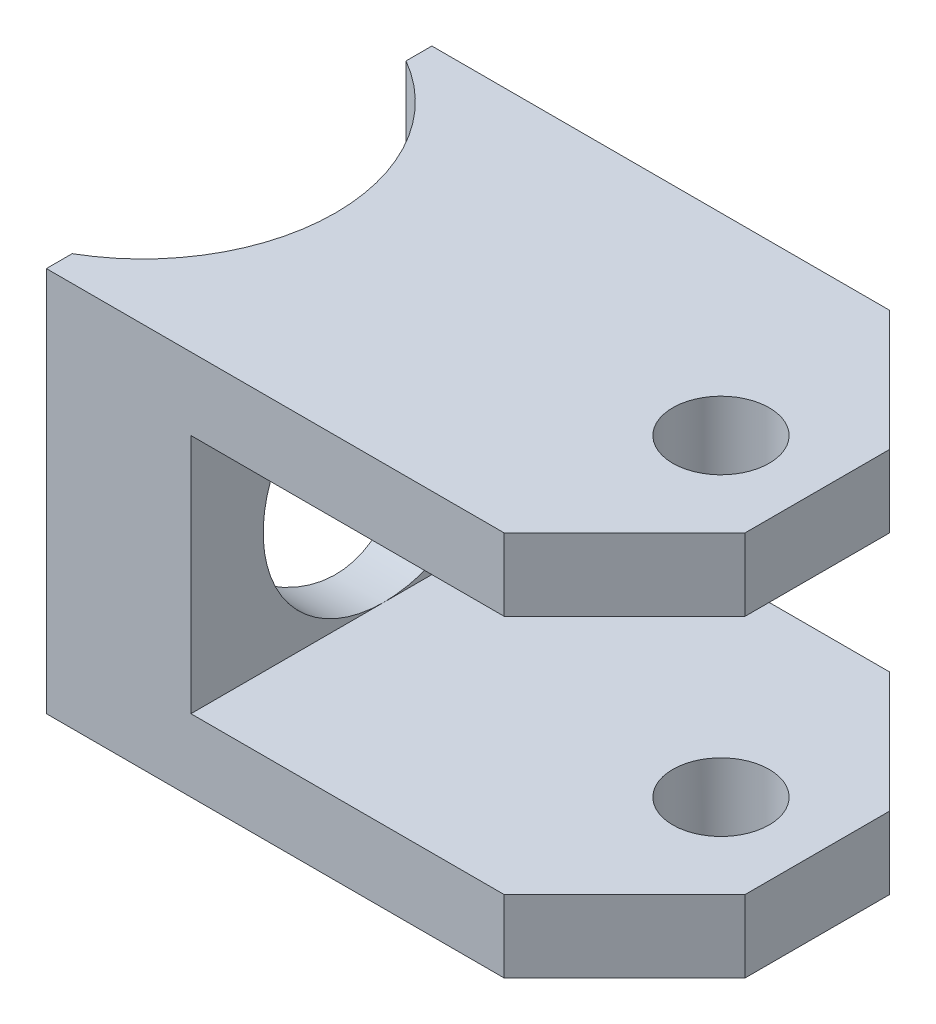
ISO-10303-21;
HEADER;
FILE_DESCRIPTION(('STEP AP214'),'2;1');
FILE_NAME('part.step','',(''),(''),'','','');
FILE_SCHEMA(('AUTOMOTIVE_DESIGN { 1 0 10303 214 1 1 1 1 }'));
ENDSEC;
DATA;
#1=APPLICATION_CONTEXT('core data for automotive mechanical design processes');
#2=APPLICATION_PROTOCOL_DEFINITION('international standard','automotive_design',2000,#1);
#3=PRODUCT_CONTEXT('',#1,'mechanical');
#4=PRODUCT('Part','Part','',(#3));
#5=PRODUCT_RELATED_PRODUCT_CATEGORY('part','',(#4));
#6=PRODUCT_DEFINITION_FORMATION('','',#4);
#7=PRODUCT_DEFINITION_CONTEXT('part definition',#1,'design');
#8=PRODUCT_DEFINITION('design','',#6,#7);
#9=PRODUCT_DEFINITION_SHAPE('','',#8);
#10=(LENGTH_UNIT() NAMED_UNIT(*) SI_UNIT(.MILLI.,.METRE.));
#11=(NAMED_UNIT(*) PLANE_ANGLE_UNIT() SI_UNIT($,.RADIAN.));
#12=(NAMED_UNIT(*) SI_UNIT($,.STERADIAN.) SOLID_ANGLE_UNIT());
#13=UNCERTAINTY_MEASURE_WITH_UNIT(LENGTH_MEASURE(1.E-05),#10,'distance_accuracy_value','');
#14=(GEOMETRIC_REPRESENTATION_CONTEXT(3) GLOBAL_UNCERTAINTY_ASSIGNED_CONTEXT((#13)) GLOBAL_UNIT_ASSIGNED_CONTEXT((#10,
#11,#12)) REPRESENTATION_CONTEXT('',''));
#15=CARTESIAN_POINT('',(0.,0.,0.));
#16=DIRECTION('',(0.,0.,1.));
#17=DIRECTION('',(1.,0.,0.));
#18=AXIS2_PLACEMENT_3D('',#15,#16,#17);
#19=CARTESIAN_POINT('',(6.35,12.7,12.7));
#20=DIRECTION('',(1.,0.,0.));
#21=DIRECTION('',(0.,0.,-1.));
#22=AXIS2_PLACEMENT_3D('',#19,#20,#21);
#23=PLANE('',#22);
#24=DIRECTION('',(0.,0.,-1.));
#25=VECTOR('',#24,1.);
#26=CARTESIAN_POINT('',(6.35,-12.7,12.7));
#27=LINE('',#26,#25);
#28=CARTESIAN_POINT('',(6.35,-12.7,-10.9985226280624));
#29=VERTEX_POINT('',#28);
#30=CARTESIAN_POINT('',(6.35,-12.7,-12.7));
#31=VERTEX_POINT('',#30);
#32=EDGE_CURVE('E169',#29,#31,#27,.T.);
#33=ORIENTED_EDGE('',*,*,#32,.F.);
#34=DIRECTION('',(0.,1.,0.));
#35=VECTOR('',#34,1.);
#36=CARTESIAN_POINT('',(6.35,-12.7,-10.9985226280624));
#37=LINE('',#36,#35);
#38=CARTESIAN_POINT('',(6.35,12.7,-10.9985226280624));
#39=VERTEX_POINT('',#38);
#40=EDGE_CURVE('E56',#29,#39,#37,.T.);
#41=ORIENTED_EDGE('',*,*,#40,.T.);
#42=DIRECTION('',(0.,0.,-1.));
#43=VECTOR('',#42,1.);
#44=CARTESIAN_POINT('',(6.35,12.7,12.7));
#45=LINE('',#44,#43);
#46=CARTESIAN_POINT('',(6.35,12.7,-12.7));
#47=VERTEX_POINT('',#46);
#48=EDGE_CURVE('E168',#39,#47,#45,.T.);
#49=ORIENTED_EDGE('',*,*,#48,.T.);
#50=DIRECTION('',(0.,-1.,0.));
#51=VECTOR('',#50,1.);
#52=CARTESIAN_POINT('',(6.35,12.7,-12.7));
#53=LINE('',#52,#51);
#54=EDGE_CURVE('E257',#47,#31,#53,.T.);
#55=ORIENTED_EDGE('',*,*,#54,.T.);
#56=EDGE_LOOP('',(#33,#41,#49,#55));
#57=FACE_BOUND('',#56,.T.);
#58=ADVANCED_FACE('F35',(#57),#23,.F.);
#59=CARTESIAN_POINT('',(15.875,7.9375,12.7));
#60=DIRECTION('',(-1.,0.,0.));
#61=DIRECTION('',(0.,0.,1.));
#62=AXIS2_PLACEMENT_3D('',#59,#60,#61);
#63=PLANE('',#62);
#64=DIRECTION('',(0.,0.,-1.));
#65=VECTOR('',#64,1.);
#66=CARTESIAN_POINT('',(15.875,7.9375,12.7));
#67=LINE('',#66,#65);
#68=CARTESIAN_POINT('',(15.875,7.9375,0.));
#69=VERTEX_POINT('',#68);
#70=CARTESIAN_POINT('',(15.875,7.9375,-12.7));
#71=VERTEX_POINT('',#70);
#72=EDGE_CURVE('E182',#69,#71,#67,.T.);
#73=ORIENTED_EDGE('',*,*,#72,.F.);
#74=CARTESIAN_POINT('',(15.875,0.,0.));
#75=DIRECTION('',(1.,0.,0.));
#76=DIRECTION('',(0.,1.,0.));
#77=AXIS2_PLACEMENT_3D('',#74,#75,#76);
#78=CIRCLE('',#77,7.9375);
#79=CARTESIAN_POINT('',(15.875,-7.9375,0.));
#80=VERTEX_POINT('',#79);
#81=EDGE_CURVE('E63',#80,#69,#78,.T.);
#82=ORIENTED_EDGE('',*,*,#81,.F.);
#83=DIRECTION('',(0.,0.,-1.));
#84=VECTOR('',#83,1.);
#85=CARTESIAN_POINT('',(15.875,-7.9375,12.7));
#86=LINE('',#85,#84);
#87=CARTESIAN_POINT('',(15.875,-7.9375,-12.7));
#88=VERTEX_POINT('',#87);
#89=EDGE_CURVE('E186',#80,#88,#86,.T.);
#90=ORIENTED_EDGE('',*,*,#89,.T.);
#91=DIRECTION('',(0.,1.,0.));
#92=VECTOR('',#91,1.);
#93=CARTESIAN_POINT('',(15.875,7.9375,-12.7));
#94=LINE('',#93,#92);
#95=EDGE_CURVE('E247',#88,#71,#94,.T.);
#96=ORIENTED_EDGE('',*,*,#95,.T.);
#97=EDGE_LOOP('',(#73,#82,#90,#96));
#98=FACE_BOUND('',#97,.T.);
#99=ADVANCED_FACE('F288',(#98),#63,.F.);
#100=CARTESIAN_POINT('',(44.45,-7.9375,12.7));
#101=DIRECTION('',(0.,-1.,0.));
#102=DIRECTION('',(0.,0.,-1.));
#103=AXIS2_PLACEMENT_3D('',#100,#101,#102);
#104=PLANE('',#103);
#105=CARTESIAN_POINT('',(38.1,-7.9375,0.));
#106=DIRECTION('',(0.,-1.,0.));
#107=DIRECTION('',(0.,0.,-1.));
#108=AXIS2_PLACEMENT_3D('',#105,#106,#107);
#109=CIRCLE('',#108,3.175);
#110=CARTESIAN_POINT('',(38.1,-7.9375,-3.175));
#111=VERTEX_POINT('',#110);
#112=EDGE_CURVE('E300',#111,#111,#109,.T.);
#113=ORIENTED_EDGE('',*,*,#112,.T.);
#114=EDGE_LOOP('',(#113));
#115=FACE_BOUND('',#114,.T.);
#116=DIRECTION('',(0.,0.,-1.));
#117=VECTOR('',#116,1.);
#118=CARTESIAN_POINT('',(44.45,-7.9375,12.7));
#119=LINE('',#118,#117);
#120=CARTESIAN_POINT('',(44.45,-7.9375,4.76249999999997));
#121=VERTEX_POINT('',#120);
#122=CARTESIAN_POINT('',(44.45,-7.9375,-4.7625));
#123=VERTEX_POINT('',#122);
#124=EDGE_CURVE('E243',#121,#123,#119,.T.);
#125=ORIENTED_EDGE('',*,*,#124,.T.);
#126=DIRECTION('',(0.707106781186549,0.,0.707106781186546));
#127=VECTOR('',#126,1.);
#128=CARTESIAN_POINT('',(44.45,-7.9375,-4.7625));
#129=LINE('',#128,#127);
#130=CARTESIAN_POINT('',(36.5125,-7.9375,-12.7));
#131=VERTEX_POINT('',#130);
#132=EDGE_CURVE('E214',#123,#131,#129,.F.);
#133=ORIENTED_EDGE('',*,*,#132,.T.);
#134=DIRECTION('',(-1.,0.,0.));
#135=VECTOR('',#134,1.);
#136=CARTESIAN_POINT('',(44.45,-7.9375,-12.7));
#137=LINE('',#136,#135);
#138=EDGE_CURVE('E244',#131,#88,#137,.T.);
#139=ORIENTED_EDGE('',*,*,#138,.T.);
#140=ORIENTED_EDGE('',*,*,#89,.F.);
#141=CARTESIAN_POINT('',(15.875,-7.9375,12.7));
#142=VERTEX_POINT('',#141);
#143=EDGE_CURVE('E187',#142,#80,#86,.T.);
#144=ORIENTED_EDGE('',*,*,#143,.F.);
#145=DIRECTION('',(-1.,0.,0.));
#146=VECTOR('',#145,1.);
#147=CARTESIAN_POINT('',(44.45,-7.9375,12.7));
#148=LINE('',#147,#146);
#149=CARTESIAN_POINT('',(36.5125,-7.9375,12.7));
#150=VERTEX_POINT('',#149);
#151=EDGE_CURVE('E262',#150,#142,#148,.T.);
#152=ORIENTED_EDGE('',*,*,#151,.F.);
#153=DIRECTION('',(0.707106781186546,0.,-0.707106781186549));
#154=VECTOR('',#153,1.);
#155=CARTESIAN_POINT('',(36.5125,-7.9375,12.7));
#156=LINE('',#155,#154);
#157=EDGE_CURVE('E212',#150,#121,#156,.T.);
#158=ORIENTED_EDGE('',*,*,#157,.T.);
#159=EDGE_LOOP('',(#125,#133,#139,#140,#144,#152,#158));
#160=FACE_BOUND('',#159,.T.);
#161=ADVANCED_FACE('F278',(#115,#160),#104,.F.);
#162=ORIENTED_EDGE('',*,*,#143,.T.);
#163=EDGE_CURVE('E295',#69,#80,#78,.T.);
#164=ORIENTED_EDGE('',*,*,#163,.F.);
#165=CARTESIAN_POINT('',(15.875,7.9375,12.7));
#166=VERTEX_POINT('',#165);
#167=EDGE_CURVE('E183',#166,#69,#67,.T.);
#168=ORIENTED_EDGE('',*,*,#167,.F.);
#169=DIRECTION('',(0.,1.,0.));
#170=VECTOR('',#169,1.);
#171=CARTESIAN_POINT('',(15.875,7.9375,12.7));
#172=LINE('',#171,#170);
#173=EDGE_CURVE('E238',#142,#166,#172,.T.);
#174=ORIENTED_EDGE('',*,*,#173,.F.);
#175=EDGE_LOOP('',(#162,#164,#168,#174));
#176=FACE_BOUND('',#175,.T.);
#177=ADVANCED_FACE('F293',(#176),#63,.F.);
#178=CARTESIAN_POINT('',(44.45,7.9375,12.7));
#179=DIRECTION('',(0.,1.,0.));
#180=DIRECTION('',(0.,0.,1.));
#181=AXIS2_PLACEMENT_3D('',#178,#179,#180);
#182=PLANE('',#181);
#183=CARTESIAN_POINT('',(38.1,7.9375,0.));
#184=DIRECTION('',(0.,1.,0.));
#185=DIRECTION('',(0.,0.,1.));
#186=AXIS2_PLACEMENT_3D('',#183,#184,#185);
#187=CIRCLE('',#186,3.175);
#188=CARTESIAN_POINT('',(38.1,7.9375,3.175));
#189=VERTEX_POINT('',#188);
#190=EDGE_CURVE('E248',#189,#189,#187,.T.);
#191=ORIENTED_EDGE('',*,*,#190,.T.);
#192=EDGE_LOOP('',(#191));
#193=FACE_BOUND('',#192,.T.);
#194=DIRECTION('',(1.,0.,0.));
#195=VECTOR('',#194,1.);
#196=CARTESIAN_POINT('',(44.45,7.9375,-12.7));
#197=LINE('',#196,#195);
#198=CARTESIAN_POINT('',(36.5125,7.9375,-12.7));
#199=VERTEX_POINT('',#198);
#200=EDGE_CURVE('E251',#71,#199,#197,.T.);
#201=ORIENTED_EDGE('',*,*,#200,.T.);
#202=DIRECTION('',(-0.707106781186549,0.,-0.707106781186546));
#203=VECTOR('',#202,1.);
#204=CARTESIAN_POINT('',(44.45,7.9375,-4.7625));
#205=LINE('',#204,#203);
#206=CARTESIAN_POINT('',(44.45,7.9375,-4.7625));
#207=VERTEX_POINT('',#206);
#208=EDGE_CURVE('E205',#199,#207,#205,.F.);
#209=ORIENTED_EDGE('',*,*,#208,.T.);
#210=DIRECTION('',(0.,0.,-1.));
#211=VECTOR('',#210,1.);
#212=CARTESIAN_POINT('',(44.45,7.9375,12.7));
#213=LINE('',#212,#211);
#214=CARTESIAN_POINT('',(44.45,7.9375,4.76249999999997));
#215=VERTEX_POINT('',#214);
#216=EDGE_CURVE('E179',#215,#207,#213,.T.);
#217=ORIENTED_EDGE('',*,*,#216,.F.);
#218=DIRECTION('',(-0.707106781186546,0.,0.707106781186549));
#219=VECTOR('',#218,1.);
#220=CARTESIAN_POINT('',(36.5125,7.9375,12.7));
#221=LINE('',#220,#219);
#222=CARTESIAN_POINT('',(36.5125,7.9375,12.7));
#223=VERTEX_POINT('',#222);
#224=EDGE_CURVE('E203',#215,#223,#221,.T.);
#225=ORIENTED_EDGE('',*,*,#224,.T.);
#226=DIRECTION('',(1.,0.,0.));
#227=VECTOR('',#226,1.);
#228=CARTESIAN_POINT('',(44.45,7.9375,12.7));
#229=LINE('',#228,#227);
#230=EDGE_CURVE('E228',#166,#223,#229,.T.);
#231=ORIENTED_EDGE('',*,*,#230,.F.);
#232=ORIENTED_EDGE('',*,*,#167,.T.);
#233=ORIENTED_EDGE('',*,*,#72,.T.);
#234=EDGE_LOOP('',(#201,#209,#217,#225,#231,#232,#233));
#235=FACE_BOUND('',#234,.T.);
#236=ADVANCED_FACE('F320',(#193,#235),#182,.F.);
#237=CARTESIAN_POINT('',(44.45,12.7,12.7));
#238=DIRECTION('',(-1.,0.,0.));
#239=DIRECTION('',(0.,0.,1.));
#240=AXIS2_PLACEMENT_3D('',#237,#238,#239);
#241=PLANE('',#240);
#242=ORIENTED_EDGE('',*,*,#216,.T.);
#243=DIRECTION('',(0.,1.,0.));
#244=VECTOR('',#243,1.);
#245=CARTESIAN_POINT('',(44.45,12.7,-4.7625));
#246=LINE('',#245,#244);
#247=CARTESIAN_POINT('',(44.45,12.7,-4.7625));
#248=VERTEX_POINT('',#247);
#249=EDGE_CURVE('E192',#207,#248,#246,.T.);
#250=ORIENTED_EDGE('',*,*,#249,.T.);
#251=DIRECTION('',(0.,0.,-1.));
#252=VECTOR('',#251,1.);
#253=CARTESIAN_POINT('',(44.45,12.7,12.7));
#254=LINE('',#253,#252);
#255=CARTESIAN_POINT('',(44.45,12.7,4.76249999999997));
#256=VERTEX_POINT('',#255);
#257=EDGE_CURVE('E176',#256,#248,#254,.T.);
#258=ORIENTED_EDGE('',*,*,#257,.F.);
#259=DIRECTION('',(0.,-1.,0.));
#260=VECTOR('',#259,1.);
#261=CARTESIAN_POINT('',(44.45,7.9375,4.76249999999997));
#262=LINE('',#261,#260);
#263=EDGE_CURVE('E190',#256,#215,#262,.T.);
#264=ORIENTED_EDGE('',*,*,#263,.T.);
#265=EDGE_LOOP('',(#242,#250,#258,#264));
#266=FACE_BOUND('',#265,.T.);
#267=ADVANCED_FACE('F322',(#266),#241,.F.);
#268=CARTESIAN_POINT('',(6.35,12.7,12.7));
#269=DIRECTION('',(0.,-1.,0.));
#270=DIRECTION('',(1.,0.,0.));
#271=AXIS2_PLACEMENT_3D('',#268,#269,#270);
#272=PLANE('',#271);
#273=CARTESIAN_POINT('',(38.1,12.7,0.));
#274=DIRECTION('',(0.,1.,0.));
#275=DIRECTION('',(0.,0.,1.));
#276=AXIS2_PLACEMENT_3D('',#273,#274,#275);
#277=CIRCLE('',#276,3.175);
#278=CARTESIAN_POINT('',(38.1,12.7,3.175));
#279=VERTEX_POINT('',#278);
#280=EDGE_CURVE('E306',#279,#279,#277,.T.);
#281=ORIENTED_EDGE('',*,*,#280,.F.);
#282=EDGE_LOOP('',(#281));
#283=FACE_BOUND('',#282,.T.);
#284=ORIENTED_EDGE('',*,*,#48,.F.);
#285=CARTESIAN_POINT('',(0.,12.7,0.));
#286=DIRECTION('',(0.,1.,0.));
#287=DIRECTION('',(-1.,0.,0.));
#288=AXIS2_PLACEMENT_3D('',#285,#286,#287);
#289=CIRCLE('',#288,12.7);
#290=CARTESIAN_POINT('',(6.35,12.7,10.9985226280624));
#291=VERTEX_POINT('',#290);
#292=EDGE_CURVE('E153',#291,#39,#289,.T.);
#293=ORIENTED_EDGE('',*,*,#292,.F.);
#294=CARTESIAN_POINT('',(6.35,12.7,12.7));
#295=VERTEX_POINT('',#294);
#296=EDGE_CURVE('E163',#295,#291,#45,.T.);
#297=ORIENTED_EDGE('',*,*,#296,.F.);
#298=DIRECTION('',(-1.,0.,0.));
#299=VECTOR('',#298,1.);
#300=CARTESIAN_POINT('',(6.35,12.7,12.7));
#301=LINE('',#300,#299);
#302=CARTESIAN_POINT('',(36.5125,12.7,12.7));
#303=VERTEX_POINT('',#302);
#304=EDGE_CURVE('E226',#303,#295,#301,.T.);
#305=ORIENTED_EDGE('',*,*,#304,.F.);
#306=DIRECTION('',(0.707106781186546,0.,-0.707106781186549));
#307=VECTOR('',#306,1.);
#308=CARTESIAN_POINT('',(36.5125,12.7,12.7));
#309=LINE('',#308,#307);
#310=EDGE_CURVE('E195',#303,#256,#309,.T.);
#311=ORIENTED_EDGE('',*,*,#310,.T.);
#312=ORIENTED_EDGE('',*,*,#257,.T.);
#313=DIRECTION('',(0.707106781186549,0.,0.707106781186546));
#314=VECTOR('',#313,1.);
#315=CARTESIAN_POINT('',(44.45,12.7,-4.7625));
#316=LINE('',#315,#314);
#317=CARTESIAN_POINT('',(36.5125,12.7,-12.7));
#318=VERTEX_POINT('',#317);
#319=EDGE_CURVE('E197',#248,#318,#316,.F.);
#320=ORIENTED_EDGE('',*,*,#319,.T.);
#321=DIRECTION('',(-1.,0.,0.));
#322=VECTOR('',#321,1.);
#323=CARTESIAN_POINT('',(6.35,12.7,-12.7));
#324=LINE('',#323,#322);
#325=EDGE_CURVE('E254',#318,#47,#324,.T.);
#326=ORIENTED_EDGE('',*,*,#325,.T.);
#327=EDGE_LOOP('',(#284,#293,#297,#305,#311,#312,#320,#326));
#328=FACE_BOUND('',#327,.T.);
#329=ADVANCED_FACE('F233',(#283,#328),#272,.F.);
#330=ORIENTED_EDGE('',*,*,#296,.T.);
#331=DIRECTION('',(0.,1.,0.));
#332=VECTOR('',#331,1.);
#333=CARTESIAN_POINT('',(6.35,-12.7,10.9985226280624));
#334=LINE('',#333,#332);
#335=CARTESIAN_POINT('',(6.35,-12.7,10.9985226280624));
#336=VERTEX_POINT('',#335);
#337=EDGE_CURVE('E148',#291,#336,#334,.F.);
#338=ORIENTED_EDGE('',*,*,#337,.T.);
#339=CARTESIAN_POINT('',(6.35,-12.7,12.7));
#340=VERTEX_POINT('',#339);
#341=EDGE_CURVE('E160',#340,#336,#27,.T.);
#342=ORIENTED_EDGE('',*,*,#341,.F.);
#343=DIRECTION('',(0.,-1.,0.));
#344=VECTOR('',#343,1.);
#345=CARTESIAN_POINT('',(6.35,12.7,12.7));
#346=LINE('',#345,#344);
#347=EDGE_CURVE('E235',#295,#340,#346,.T.);
#348=ORIENTED_EDGE('',*,*,#347,.F.);
#349=EDGE_LOOP('',(#330,#338,#342,#348));
#350=FACE_BOUND('',#349,.T.);
#351=ADVANCED_FACE('F158',(#350),#23,.F.);
#352=CARTESIAN_POINT('',(6.35,-12.7,12.7));
#353=DIRECTION('',(0.,1.,0.));
#354=DIRECTION('',(-1.,0.,0.));
#355=AXIS2_PLACEMENT_3D('',#352,#353,#354);
#356=PLANE('',#355);
#357=CARTESIAN_POINT('',(38.1,-12.7,0.));
#358=DIRECTION('',(0.,1.,0.));
#359=DIRECTION('',(0.,0.,1.));
#360=AXIS2_PLACEMENT_3D('',#357,#358,#359);
#361=CIRCLE('',#360,3.175);
#362=CARTESIAN_POINT('',(38.1,-12.7,3.175));
#363=VERTEX_POINT('',#362);
#364=EDGE_CURVE('E303',#363,#363,#361,.T.);
#365=ORIENTED_EDGE('',*,*,#364,.T.);
#366=EDGE_LOOP('',(#365));
#367=FACE_BOUND('',#366,.T.);
#368=ORIENTED_EDGE('',*,*,#341,.T.);
#369=CARTESIAN_POINT('',(0.,-12.7,0.));
#370=DIRECTION('',(0.,1.,0.));
#371=DIRECTION('',(-1.,0.,0.));
#372=AXIS2_PLACEMENT_3D('',#369,#370,#371);
#373=CIRCLE('',#372,12.7);
#374=EDGE_CURVE('E145',#336,#29,#373,.T.);
#375=ORIENTED_EDGE('',*,*,#374,.T.);
#376=ORIENTED_EDGE('',*,*,#32,.T.);
#377=DIRECTION('',(1.,0.,0.));
#378=VECTOR('',#377,1.);
#379=CARTESIAN_POINT('',(6.35,-12.7,-12.7));
#380=LINE('',#379,#378);
#381=CARTESIAN_POINT('',(36.5125,-12.7,-12.7));
#382=VERTEX_POINT('',#381);
#383=EDGE_CURVE('E260',#31,#382,#380,.T.);
#384=ORIENTED_EDGE('',*,*,#383,.T.);
#385=DIRECTION('',(-0.707106781186549,0.,-0.707106781186546));
#386=VECTOR('',#385,1.);
#387=CARTESIAN_POINT('',(44.45,-12.7,-4.7625));
#388=LINE('',#387,#386);
#389=CARTESIAN_POINT('',(44.45,-12.7,-4.7625));
#390=VERTEX_POINT('',#389);
#391=EDGE_CURVE('E218',#382,#390,#388,.F.);
#392=ORIENTED_EDGE('',*,*,#391,.T.);
#393=DIRECTION('',(0.,0.,-1.));
#394=VECTOR('',#393,1.);
#395=CARTESIAN_POINT('',(44.45,-12.7,12.7));
#396=LINE('',#395,#394);
#397=CARTESIAN_POINT('',(44.45,-12.7,4.76249999999997));
#398=VERTEX_POINT('',#397);
#399=EDGE_CURVE('E172',#398,#390,#396,.T.);
#400=ORIENTED_EDGE('',*,*,#399,.F.);
#401=DIRECTION('',(-0.707106781186546,0.,0.707106781186549));
#402=VECTOR('',#401,1.);
#403=CARTESIAN_POINT('',(36.5125,-12.7,12.7));
#404=LINE('',#403,#402);
#405=CARTESIAN_POINT('',(36.5125,-12.7,12.7));
#406=VERTEX_POINT('',#405);
#407=EDGE_CURVE('E216',#398,#406,#404,.T.);
#408=ORIENTED_EDGE('',*,*,#407,.T.);
#409=DIRECTION('',(1.,0.,0.));
#410=VECTOR('',#409,1.);
#411=CARTESIAN_POINT('',(6.35,-12.7,12.7));
#412=LINE('',#411,#410);
#413=EDGE_CURVE('E167',#340,#406,#412,.T.);
#414=ORIENTED_EDGE('',*,*,#413,.F.);
#415=EDGE_LOOP('',(#368,#375,#376,#384,#392,#400,#408,#414));
#416=FACE_BOUND('',#415,.T.);
#417=ADVANCED_FACE('F165',(#367,#416),#356,.F.);
#418=CARTESIAN_POINT('',(44.45,-12.7,12.7));
#419=DIRECTION('',(-1.,0.,0.));
#420=DIRECTION('',(0.,0.,1.));
#421=AXIS2_PLACEMENT_3D('',#418,#419,#420);
#422=PLANE('',#421);
#423=ORIENTED_EDGE('',*,*,#399,.T.);
#424=DIRECTION('',(0.,1.,0.));
#425=VECTOR('',#424,1.);
#426=CARTESIAN_POINT('',(44.45,-12.7,-4.7625));
#427=LINE('',#426,#425);
#428=EDGE_CURVE('E209',#390,#123,#427,.T.);
#429=ORIENTED_EDGE('',*,*,#428,.T.);
#430=ORIENTED_EDGE('',*,*,#124,.F.);
#431=DIRECTION('',(0.,-1.,0.));
#432=VECTOR('',#431,1.);
#433=CARTESIAN_POINT('',(44.45,-12.7,4.76249999999997));
#434=LINE('',#433,#432);
#435=EDGE_CURVE('E207',#121,#398,#434,.T.);
#436=ORIENTED_EDGE('',*,*,#435,.T.);
#437=EDGE_LOOP('',(#423,#429,#430,#436));
#438=FACE_BOUND('',#437,.T.);
#439=ADVANCED_FACE('F270',(#438),#422,.F.);
#440=CARTESIAN_POINT('',(0.,0.,12.7));
#441=DIRECTION('',(0.,0.,1.));
#442=DIRECTION('',(1.,0.,0.));
#443=AXIS2_PLACEMENT_3D('',#440,#441,#442);
#444=PLANE('',#443);
#445=ORIENTED_EDGE('',*,*,#413,.T.);
#446=DIRECTION('',(0.,1.,0.));
#447=VECTOR('',#446,1.);
#448=CARTESIAN_POINT('',(36.5125,-7.9375,12.7));
#449=LINE('',#448,#447);
#450=EDGE_CURVE('E11',#406,#150,#449,.T.);
#451=ORIENTED_EDGE('',*,*,#450,.T.);
#452=ORIENTED_EDGE('',*,*,#151,.T.);
#453=ORIENTED_EDGE('',*,*,#173,.T.);
#454=ORIENTED_EDGE('',*,*,#230,.T.);
#455=DIRECTION('',(0.,1.,0.));
#456=VECTOR('',#455,1.);
#457=CARTESIAN_POINT('',(36.5125,12.7,12.7));
#458=LINE('',#457,#456);
#459=EDGE_CURVE('E49',#223,#303,#458,.T.);
#460=ORIENTED_EDGE('',*,*,#459,.T.);
#461=ORIENTED_EDGE('',*,*,#304,.T.);
#462=ORIENTED_EDGE('',*,*,#347,.T.);
#463=EDGE_LOOP('',(#445,#451,#452,#453,#454,#460,#461,#462));
#464=FACE_BOUND('',#463,.T.);
#465=ADVANCED_FACE('F225',(#464),#444,.T.);
#466=CARTESIAN_POINT('',(0.,0.,-12.7));
#467=DIRECTION('',(0.,0.,1.));
#468=DIRECTION('',(1.,0.,0.));
#469=AXIS2_PLACEMENT_3D('',#466,#467,#468);
#470=PLANE('',#469);
#471=ORIENTED_EDGE('',*,*,#325,.F.);
#472=DIRECTION('',(0.,-1.,0.));
#473=VECTOR('',#472,1.);
#474=CARTESIAN_POINT('',(36.5125,0.,-12.7));
#475=LINE('',#474,#473);
#476=EDGE_CURVE('E201',#318,#199,#475,.T.);
#477=ORIENTED_EDGE('',*,*,#476,.T.);
#478=ORIENTED_EDGE('',*,*,#200,.F.);
#479=ORIENTED_EDGE('',*,*,#95,.F.);
#480=ORIENTED_EDGE('',*,*,#138,.F.);
#481=DIRECTION('',(0.,-1.,0.));
#482=VECTOR('',#481,1.);
#483=CARTESIAN_POINT('',(36.5125,0.,-12.7));
#484=LINE('',#483,#482);
#485=EDGE_CURVE('E199',#131,#382,#484,.T.);
#486=ORIENTED_EDGE('',*,*,#485,.T.);
#487=ORIENTED_EDGE('',*,*,#383,.F.);
#488=ORIENTED_EDGE('',*,*,#54,.F.);
#489=EDGE_LOOP('',(#471,#477,#478,#479,#480,#486,#487,#488));
#490=FACE_BOUND('',#489,.T.);
#491=ADVANCED_FACE('F283',(#490),#470,.F.);
#492=CARTESIAN_POINT('',(38.1,12.7,0.));
#493=DIRECTION('',(0.,1.,0.));
#494=DIRECTION('',(0.,0.,1.));
#495=AXIS2_PLACEMENT_3D('',#492,#493,#494);
#496=CYLINDRICAL_SURFACE('',#495,3.175);
#497=ORIENTED_EDGE('',*,*,#280,.T.);
#498=EDGE_LOOP('',(#497));
#499=FACE_BOUND('',#498,.T.);
#500=ORIENTED_EDGE('',*,*,#190,.F.);
#501=EDGE_LOOP('',(#500));
#502=FACE_BOUND('',#501,.T.);
#503=ADVANCED_FACE('F445',(#499,#502),#496,.F.);
#504=ORIENTED_EDGE('',*,*,#364,.F.);
#505=EDGE_LOOP('',(#504));
#506=FACE_BOUND('',#505,.T.);
#507=ORIENTED_EDGE('',*,*,#112,.F.);
#508=EDGE_LOOP('',(#507));
#509=FACE_BOUND('',#508,.T.);
#510=ADVANCED_FACE('F363',(#506,#509),#496,.F.);
#511=CARTESIAN_POINT('',(44.45,12.7,-4.7625));
#512=DIRECTION('',(-0.707106781186546,0.,0.707106781186549));
#513=DIRECTION('',(0.,1.,0.));
#514=AXIS2_PLACEMENT_3D('',#511,#512,#513);
#515=PLANE('',#514);
#516=ORIENTED_EDGE('',*,*,#208,.F.);
#517=ORIENTED_EDGE('',*,*,#476,.F.);
#518=ORIENTED_EDGE('',*,*,#319,.F.);
#519=ORIENTED_EDGE('',*,*,#249,.F.);
#520=EDGE_LOOP('',(#516,#517,#518,#519));
#521=FACE_BOUND('',#520,.T.);
#522=ADVANCED_FACE('F316',(#521),#515,.F.);
#523=CARTESIAN_POINT('',(44.45,-12.7,-4.7625));
#524=DIRECTION('',(-0.707106781186546,0.,0.707106781186549));
#525=DIRECTION('',(0.,1.,0.));
#526=AXIS2_PLACEMENT_3D('',#523,#524,#525);
#527=PLANE('',#526);
#528=ORIENTED_EDGE('',*,*,#391,.F.);
#529=ORIENTED_EDGE('',*,*,#485,.F.);
#530=ORIENTED_EDGE('',*,*,#132,.F.);
#531=ORIENTED_EDGE('',*,*,#428,.F.);
#532=EDGE_LOOP('',(#528,#529,#530,#531));
#533=FACE_BOUND('',#532,.T.);
#534=ADVANCED_FACE('F275',(#533),#527,.F.);
#535=CARTESIAN_POINT('',(36.5125,0.,12.7));
#536=DIRECTION('',(0.707106781186549,0.,0.707106781186546));
#537=DIRECTION('',(0.,-1.,0.));
#538=AXIS2_PLACEMENT_3D('',#535,#536,#537);
#539=PLANE('',#538);
#540=ORIENTED_EDGE('',*,*,#407,.F.);
#541=ORIENTED_EDGE('',*,*,#435,.F.);
#542=ORIENTED_EDGE('',*,*,#157,.F.);
#543=ORIENTED_EDGE('',*,*,#450,.F.);
#544=EDGE_LOOP('',(#540,#541,#542,#543));
#545=FACE_BOUND('',#544,.T.);
#546=ADVANCED_FACE('F326',(#545),#539,.T.);
#547=CARTESIAN_POINT('',(36.5125,0.,12.7));
#548=DIRECTION('',(0.707106781186549,0.,0.707106781186546));
#549=DIRECTION('',(0.,-1.,0.));
#550=AXIS2_PLACEMENT_3D('',#547,#548,#549);
#551=PLANE('',#550);
#552=ORIENTED_EDGE('',*,*,#224,.F.);
#553=ORIENTED_EDGE('',*,*,#263,.F.);
#554=ORIENTED_EDGE('',*,*,#310,.F.);
#555=ORIENTED_EDGE('',*,*,#459,.F.);
#556=EDGE_LOOP('',(#552,#553,#554,#555));
#557=FACE_BOUND('',#556,.T.);
#558=ADVANCED_FACE('F37',(#557),#551,.T.);
#559=CARTESIAN_POINT('',(6.34999999999999,0.,0.));
#560=DIRECTION('',(1.,0.,0.));
#561=DIRECTION('',(0.,1.,0.));
#562=AXIS2_PLACEMENT_3D('',#559,#560,#561);
#563=CYLINDRICAL_SURFACE('',#562,7.9375);
#564=CARTESIAN_POINT('',(12.7,7.93750000000001,0.));
#565=CARTESIAN_POINT('',(12.6999995271497,7.93749953499279,-0.201739041368471));
#566=CARTESIAN_POINT('',(12.6951823769645,7.92979870263526,-0.403488446576434));
#567=CARTESIAN_POINT('',(12.6760313233409,7.89910238445761,-0.805443060018178));
#568=CARTESIAN_POINT('',(12.6616932845254,7.87610025254355,-1.00564755898276));
#569=CARTESIAN_POINT('',(12.6238293555292,7.81508453956653,-1.40315814184426));
#570=CARTESIAN_POINT('',(12.60029053374,7.77704982952284,-1.60045973896419));
#571=CARTESIAN_POINT('',(12.5445847947299,7.68646789068216,-1.99053521067712));
#572=CARTESIAN_POINT('',(12.5124142281596,7.63391452337359,-2.18330713262609));
#573=CARTESIAN_POINT('',(12.4403893256155,7.51527787325432,-2.56196376123141));
#574=CARTESIAN_POINT('',(12.400577675679,7.44926963308425,-2.74788019033168));
#575=CARTESIAN_POINT('',(12.3140034287051,7.3042433100681,-3.11296282478008));
#576=CARTESIAN_POINT('',(12.2672381396281,7.22522018734494,-3.29212638199121));
#577=CARTESIAN_POINT('',(12.1677433174236,7.0549739217575,-3.64269021438579));
#578=CARTESIAN_POINT('',(12.1150173925053,6.96375815354961,-3.81409509912128));
#579=CARTESIAN_POINT('',(12.004586123078,6.76981016401713,-4.14861337783258));
#580=CARTESIAN_POINT('',(11.9468789409286,6.66707368836083,-4.31172367627709));
#581=CARTESIAN_POINT('',(11.7583657794388,6.32543868247449,-4.81294866145539));
#582=CARTESIAN_POINT('',(11.620282975097,6.06661079060303,-5.13503247600621));
#583=CARTESIAN_POINT('',(11.3367012888174,5.50398780175486,-5.73404632799171));
#584=CARTESIAN_POINT('',(11.1911926166807,5.2001322812532,-6.01091462379353));
#585=CARTESIAN_POINT('',(10.9670269062116,4.69220024274918,-6.40636593989623));
#586=CARTESIAN_POINT('',(10.8866342624886,4.50169520891754,-6.54167320119787));
#587=CARTESIAN_POINT('',(10.7299063704343,4.10820920027475,-6.79568677227649));
#588=CARTESIAN_POINT('',(10.6535718836913,3.90522589899066,-6.91438997276443));
#589=CARTESIAN_POINT('',(10.5077692969768,3.48787802658061,-7.13401347491112));
#590=CARTESIAN_POINT('',(10.438292000526,3.27352930831124,-7.23495774013726));
#591=CARTESIAN_POINT('',(10.3089642658697,2.83419265944876,-7.41807462208145));
#592=CARTESIAN_POINT('',(10.2491098464071,2.60920917887079,-7.50025500789233));
#593=CARTESIAN_POINT('',(10.1558363122562,2.20958661829698,-7.62583887352565));
#594=CARTESIAN_POINT('',(10.1195869036081,2.03702003937505,-7.67377170148966));
#595=CARTESIAN_POINT('',(10.0550866460714,1.68763804361595,-7.75809620793248));
#596=CARTESIAN_POINT('',(10.0268338590457,1.51082366760552,-7.79449068321333));
#597=CARTESIAN_POINT('',(9.97932639849934,1.15414787294095,-7.85522342720327));
#598=CARTESIAN_POINT('',(9.96006123486658,0.974290261753222,-7.87957575318649));
#599=CARTESIAN_POINT('',(9.93120380433546,0.612546165554992,-7.91591648836484));
#600=CARTESIAN_POINT('',(9.92161166997629,0.430659652779139,-7.92790472814816));
#601=CARTESIAN_POINT('',(9.91247017307351,0.0657552660776787,-7.93933187604833));
#602=CARTESIAN_POINT('',(9.91294742664987,-0.117264327578581,-7.93873752495498));
#603=CARTESIAN_POINT('',(9.923990668663,-0.482517284842519,-7.92492809864644));
#604=CARTESIAN_POINT('',(9.93455670925072,-0.664750644381106,-7.91171295819188));
#605=CARTESIAN_POINT('',(9.96536796005381,-1.02717928073088,-7.87286806727876));
#606=CARTESIAN_POINT('',(9.98561986789098,-1.2073730588109,-7.84722972621482));
#607=CARTESIAN_POINT('',(10.0350439745423,-1.56437831658881,-7.78392567936421));
#608=CARTESIAN_POINT('',(10.0642163692056,-1.74118972193616,-7.74625970951021));
#609=CARTESIAN_POINT('',(10.1297083322288,-2.0863728495448,-7.66040790802239));
#610=CARTESIAN_POINT('',(10.1658463405013,-2.25484520669523,-7.61248647387731));
#611=CARTESIAN_POINT('',(10.2446166744486,-2.58691330612416,-7.50614440051444));
#612=CARTESIAN_POINT('',(10.2872511990475,-2.75050737470939,-7.44772020514098));
#613=CARTESIAN_POINT('',(10.4232095032807,-3.23301636146897,-7.25747941686763));
#614=CARTESIAN_POINT('',(10.5246228915014,-3.54383146007847,-7.11065079582381));
#615=CARTESIAN_POINT('',(10.7604036293399,-4.1963740393648,-6.74968610006634));
#616=CARTESIAN_POINT('',(10.897388002474,-4.53302972024284,-6.52810038196324));
#617=CARTESIAN_POINT('',(11.1065825424675,-5.00902431475109,-6.16066831196553));
#618=CARTESIAN_POINT('',(11.1769908705652,-5.16296792737679,-6.03223324047688));
#619=CARTESIAN_POINT('',(11.3176517824192,-5.46080602972515,-5.76399717035519));
#620=CARTESIAN_POINT('',(11.387904336547,-5.60469874398706,-5.6241941730042));
#621=CARTESIAN_POINT('',(11.5383283643624,-5.90478278495735,-5.30963244227627));
#622=CARTESIAN_POINT('',(11.6182179558014,-6.05907031904445,-5.13291711894878));
#623=CARTESIAN_POINT('',(11.7737218098498,-6.35215327111167,-4.76542385358572));
#624=CARTESIAN_POINT('',(11.8493376303672,-6.49095435254101,-4.57465109506246));
#625=CARTESIAN_POINT('',(11.9943091573518,-6.75197270825117,-4.17980536221483));
#626=CARTESIAN_POINT('',(12.0636647829484,-6.87418976830651,-3.97573221613199));
#627=CARTESIAN_POINT('',(12.1941669226276,-7.10071717435151,-3.55537666295463));
#628=CARTESIAN_POINT('',(12.2553144104427,-7.20502964477509,-3.33909570840597));
#629=CARTESIAN_POINT('',(12.3645495647379,-7.38926185561915,-2.90769946998035));
#630=CARTESIAN_POINT('',(12.4131638299647,-7.47019396643397,-2.6931507971941));
#631=CARTESIAN_POINT('',(12.5000190911817,-7.61364865613235,-2.25592151368444));
#632=CARTESIAN_POINT('',(12.5382602797881,-7.67617157685525,-2.03324105404608));
#633=CARTESIAN_POINT('',(12.6031521101227,-7.78171449981311,-1.58191912498485));
#634=CARTESIAN_POINT('',(12.6298163650185,-7.82475741087987,-1.35328499373077));
#635=CARTESIAN_POINT('',(12.6707471230346,-7.89065342723416,-0.892040639280498));
#636=CARTESIAN_POINT('',(12.6850157439542,-7.91350998138035,-0.65943110221138));
#637=CARTESIAN_POINT('',(12.6995215932854,-7.93673818597211,-0.227391919887282));
#638=CARTESIAN_POINT('',(12.7015286337723,-7.93994609714296,-0.0281675793366328));
#639=CARTESIAN_POINT('',(12.6961733496655,-7.93137681681763,0.369831100816881));
#640=CARTESIAN_POINT('',(12.6888114971498,-7.91960038034993,0.568605462587634));
#641=CARTESIAN_POINT('',(12.6649005280717,-7.88123309303378,0.964132789286349));
#642=CARTESIAN_POINT('',(12.6483523059838,-7.85464368451963,1.16088594911879));
#643=CARTESIAN_POINT('',(12.6064690220913,-7.78701944038208,1.55093994632036));
#644=CARTESIAN_POINT('',(12.5811338053126,-7.74598434998349,1.74424072273741));
#645=CARTESIAN_POINT('',(12.5234284558002,-7.65189452223095,2.11853172321314));
#646=CARTESIAN_POINT('',(12.4913751444938,-7.59937759450793,2.29970680807441));
#647=CARTESIAN_POINT('',(12.4203505280082,-7.48205804607719,2.65669551879437));
#648=CARTESIAN_POINT('',(12.381376992642,-7.41725146431224,2.83250739477919));
#649=CARTESIAN_POINT('',(12.2972794365285,-7.27600236673,3.17781013983771));
#650=CARTESIAN_POINT('',(12.2521571114706,-7.19956305826493,3.34730273526275));
#651=CARTESIAN_POINT('',(12.156576218053,-7.03567096646305,3.67934207474231));
#652=CARTESIAN_POINT('',(12.1061157126561,-6.94821418306189,3.84188626721929));
#653=CARTESIAN_POINT('',(11.937417364832,-6.6516260703067,4.35009370138634));
#654=CARTESIAN_POINT('',(11.8105091361349,-6.42242187998982,4.68143891923279));
#655=CARTESIAN_POINT('',(11.5447104890348,-5.91945435068259,5.30323518058702));
#656=CARTESIAN_POINT('',(11.405806840987,-5.64564151048665,5.59364011807453));
#657=CARTESIAN_POINT('',(11.1864111996025,-5.18377492062231,6.01533332752689));
#658=CARTESIAN_POINT('',(11.106302776779,-5.00902405345218,6.16161637869312));
#659=CARTESIAN_POINT('',(10.9478371930905,-4.64709912372846,6.43897528209488));
#660=CARTESIAN_POINT('',(10.8694803303254,-4.45992296769908,6.57004856143535));
#661=CARTESIAN_POINT('',(10.6405689035884,-3.88089976449759,6.93914755260478));
#662=CARTESIAN_POINT('',(10.4959012149404,-3.47101162945262,7.15355254202931));
#663=CARTESIAN_POINT('',(10.2700626331894,-2.70058936807609,7.47302041242335));
#664=CARTESIAN_POINT('',(10.1819383102508,-2.34772073021856,7.59158257265494));
#665=CARTESIAN_POINT('',(10.0751823982188,-1.80413256207853,7.73201627349787));
#666=CARTESIAN_POINT('',(10.0438413681554,-1.62061541729438,7.77258572070265));
#667=CARTESIAN_POINT('',(9.99071735990999,-1.24977975093962,7.84075654091829));
#668=CARTESIAN_POINT('',(9.96893435219273,-1.06246124111749,7.86835795400166));
#669=CARTESIAN_POINT('',(9.93572826332503,-0.684312945446901,7.9102480110533));
#670=CARTESIAN_POINT('',(9.92436609699732,-0.493469083693613,7.92445839109539));
#671=CARTESIAN_POINT('',(9.91271153768567,-0.110909988366779,7.93903274223715));
#672=CARTESIAN_POINT('',(9.91241909588715,0.0808052413605353,7.93939677439559));
#673=CARTESIAN_POINT('',(9.92291937503835,0.463508329200538,7.92626891419433));
#674=CARTESIAN_POINT('',(9.93371546371979,0.654495948641021,7.9127728123308));
#675=CARTESIAN_POINT('',(9.9659258439773,1.03409789130421,7.87216544677196));
#676=CARTESIAN_POINT('',(9.98733998574489,1.22271224797242,7.84505437516811));
#677=CARTESIAN_POINT('',(10.0377764838101,1.58105941210102,7.78039679661612));
#678=CARTESIAN_POINT('',(10.0660431645518,1.75108527126051,7.74387197931696));
#679=CARTESIAN_POINT('',(10.1298995607313,2.08710799889913,7.66015013960237));
#680=CARTESIAN_POINT('',(10.165491717853,2.25310350332707,7.61294955828487));
#681=CARTESIAN_POINT('',(10.2817408178653,2.7438993855811,7.45605656918077));
#682=CARTESIAN_POINT('',(10.3718959443922,3.06167864250888,7.33104170015385));
#683=CARTESIAN_POINT('',(10.5831618617515,3.71858241310546,7.02326627827775));
#684=CARTESIAN_POINT('',(10.7068646078418,4.05413685229279,6.83476595879602));
#685=CARTESIAN_POINT('',(10.9644113957568,4.69228119333398,6.41347152197481));
#686=CARTESIAN_POINT('',(11.0982635835211,4.9948441311101,6.18064159435185));
#687=CARTESIAN_POINT('',(11.3119808323797,5.44952756406374,5.77569391220568));
#688=CARTESIAN_POINT('',(11.3920004641966,5.61337366376788,5.61660064645281));
#689=CARTESIAN_POINT('',(11.5499050443204,5.9272785433129,5.28426957717029));
#690=CARTESIAN_POINT('',(11.6277898026678,6.07733609903577,5.1110305203805));
#691=CARTESIAN_POINT('',(11.7794885538049,6.36277262458992,4.75098347114556));
#692=CARTESIAN_POINT('',(11.8532999239987,6.49814219070814,4.56416691225762));
#693=CARTESIAN_POINT('',(11.9949251985636,6.75302630476872,4.17780989523751));
#694=CARTESIAN_POINT('',(12.0627385050067,6.87253927260914,3.97826817197835));
#695=CARTESIAN_POINT('',(12.1906785228666,7.09470320989309,3.56704578084192));
#696=CARTESIAN_POINT('',(12.250788699695,7.19731803802599,3.35534036839001));
#697=CARTESIAN_POINT('',(12.361398636913,7.38401902310278,2.92162024534504));
#698=CARTESIAN_POINT('',(12.4119039457019,7.46811588169564,2.69961157936523));
#699=CARTESIAN_POINT('',(12.5016678369712,7.61636899488248,2.24750287628486));
#700=CARTESIAN_POINT('',(12.5409566741509,7.68057893190416,2.01742652180656));
#701=CARTESIAN_POINT('',(12.6071528727039,7.78819732114139,1.55084845588795));
#702=CARTESIAN_POINT('',(12.634069365522,7.83162111561288,1.31435162007781));
#703=CARTESIAN_POINT('',(12.6694661102002,7.88857562363261,0.898061516717915));
#704=CARTESIAN_POINT('',(12.6808951070959,7.90690173667894,0.719156625233637));
#705=CARTESIAN_POINT('',(12.6961624979591,7.93136450964793,0.360170623508276));
#706=CARTESIAN_POINT('',(12.7000004221064,7.93750041510503,0.180089441157222));
#707=CARTESIAN_POINT('',(12.7,7.93750000000001,0.));
#708=B_SPLINE_CURVE_WITH_KNOTS('',3,(#564,#565,#566,#567,#568,#569,#570,#571,#572,#573,#574,
#575,#576,#577,#578,#579,#580,#581,#582,#583,#584,#585,#586,#587,#588,#589,#590,#591,#592,#593,
#594,#595,#596,#597,#598,#599,#600,#601,#602,#603,#604,#605,#606,#607,#608,#609,#610,#611,#612,
#613,#614,#615,#616,#617,#618,#619,#620,#621,#622,#623,#624,#625,#626,#627,#628,#629,#630,#631,
#632,#633,#634,#635,#636,#637,#638,#639,#640,#641,#642,#643,#644,#645,#646,#647,#648,#649,#650,
#651,#652,#653,#654,#655,#656,#657,#658,#659,#660,#661,#662,#663,#664,#665,#666,#667,#668,#669,
#670,#671,#672,#673,#674,#675,#676,#677,#678,#679,#680,#681,#682,#683,#684,#685,#686,#687,#688,
#689,#690,#691,#692,#693,#694,#695,#696,#697,#698,#699,#700,#701,#702,#703,#704,#705,#706,#707),
.UNSPECIFIED.,.T.,.F.,(4,2,2,2,2,2,2,2,2,2,2,2,2,2,2,2,2,2,2,2,2,2,2,2,2,2,2,2,2,2,2,2,2,2,2,2,
2,2,2,2,2,2,2,2,2,2,2,2,2,2,2,2,2,2,2,2,2,2,2,2,2,2,2,2,2,2,2,2,2,2,2,4),(0.,0.605032466965532,
1.21032790051417,1.81647714760341,2.42288306882269,3.0259951020022,3.62934123551352,
4.23232407584535,4.83553032169086,6.13713310641446,7.44049862716951,8.181056339442,
8.92175254399168,9.66144147049492,10.4008235747676,10.9484871921508,11.4960179586916,
12.0429080532745,12.5898056412066,13.1381490082851,13.6864952098747,14.2352211334837,
14.7839591052322,15.319963521766,15.8561497683577,16.9279807748438,18.2000370601928,
18.8370734993811,19.4742221860236,20.2167821016984,20.9590695643509,21.7013666146512,
22.4435755281765,23.1457425675394,23.8478965675749,24.5492226627341,25.2504289124566,
25.8474483559121,26.4444377180554,27.0413689616944,27.6383107338014,28.2117120916599,
28.7852985766026,29.3587271989932,29.9323646167724,31.1943593027149,32.4577640553728,
33.1817121045419,33.9057824392656,35.3515833534236,36.4943111364462,37.0653170546956,
37.6363212084685,38.2106422690401,38.7849607970061,39.3594538046143,39.9339387070196,
40.4619467685538,40.990131108421,42.0459823290161,43.2546905874606,44.4643794378768,
45.1896481558809,45.9149811996373,46.6407759178751,47.3666429069534,48.0940427464342,
48.8210211073283,49.5460196181382,50.2704821791066,50.8105522373992,51.3506557201891),.UNSPECIFIED.);
#709=CARTESIAN_POINT('',(12.7,7.93750000000001,0.));
#710=VERTEX_POINT('',#709);
#711=EDGE_CURVE('E39',#710,#710,#708,.T.);
#712=ORIENTED_EDGE('',*,*,#711,.T.);
#713=EDGE_LOOP('',(#712));
#714=FACE_BOUND('',#713,.T.);
#715=ORIENTED_EDGE('',*,*,#163,.T.);
#716=ORIENTED_EDGE('',*,*,#81,.T.);
#717=EDGE_LOOP('',(#715,#716));
#718=FACE_BOUND('',#717,.T.);
#719=ADVANCED_FACE('F325',(#714,#718),#563,.F.);
#720=CARTESIAN_POINT('',(0.,-12.7,0.));
#721=DIRECTION('',(0.,1.,0.));
#722=DIRECTION('',(-1.,0.,0.));
#723=AXIS2_PLACEMENT_3D('',#720,#721,#722);
#724=CYLINDRICAL_SURFACE('',#723,12.7);
#725=ORIENTED_EDGE('',*,*,#711,.F.);
#726=EDGE_LOOP('',(#725));
#727=FACE_BOUND('',#726,.T.);
#728=ORIENTED_EDGE('',*,*,#374,.F.);
#729=ORIENTED_EDGE('',*,*,#337,.F.);
#730=ORIENTED_EDGE('',*,*,#292,.T.);
#731=ORIENTED_EDGE('',*,*,#40,.F.);
#732=EDGE_LOOP('',(#728,#729,#730,#731));
#733=FACE_BOUND('',#732,.T.);
#734=ADVANCED_FACE('F147',(#727,#733),#724,.F.);
#735=CLOSED_SHELL('',(#58,#99,#161,#177,#236,#267,#329,#351,#417,#439,#465,#491,#503,#510,#522,
#534,#546,#558,#719,#734));
#736=MANIFOLD_SOLID_BREP('B2',#735);
#737=ADVANCED_BREP_SHAPE_REPRESENTATION('',(#18,#736),#14);
#738=SHAPE_DEFINITION_REPRESENTATION(#9,#737);
ENDSEC;
END-ISO-10303-21;
